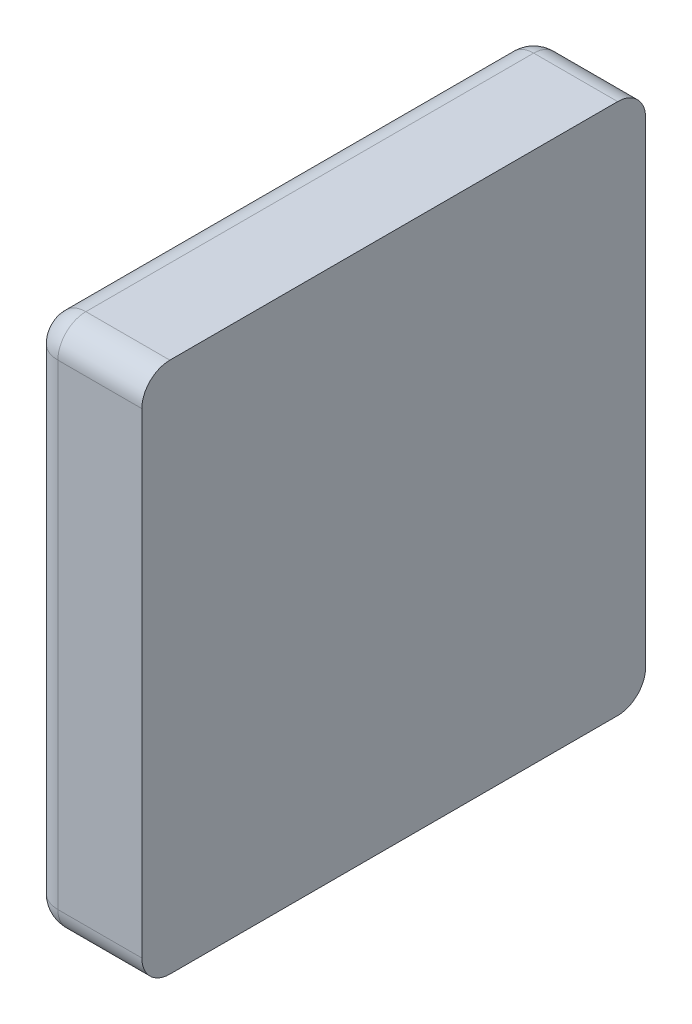
ISO-10303-21;
HEADER;
FILE_DESCRIPTION(('STEP AP214'),'2;1');
FILE_NAME('part.step','',(''),(''),'','','');
FILE_SCHEMA(('AUTOMOTIVE_DESIGN { 1 0 10303 214 1 1 1 1 }'));
ENDSEC;
DATA;
#1=APPLICATION_CONTEXT('core data for automotive mechanical design processes');
#2=APPLICATION_PROTOCOL_DEFINITION('international standard','automotive_design',2000,#1);
#3=PRODUCT_CONTEXT('',#1,'mechanical');
#4=PRODUCT('Part','Part','',(#3));
#5=PRODUCT_RELATED_PRODUCT_CATEGORY('part','',(#4));
#6=PRODUCT_DEFINITION_FORMATION('','',#4);
#7=PRODUCT_DEFINITION_CONTEXT('part definition',#1,'design');
#8=PRODUCT_DEFINITION('design','',#6,#7);
#9=PRODUCT_DEFINITION_SHAPE('','',#8);
#10=(LENGTH_UNIT() NAMED_UNIT(*) SI_UNIT(.MILLI.,.METRE.));
#11=(NAMED_UNIT(*) PLANE_ANGLE_UNIT() SI_UNIT($,.RADIAN.));
#12=(NAMED_UNIT(*) SI_UNIT($,.STERADIAN.) SOLID_ANGLE_UNIT());
#13=UNCERTAINTY_MEASURE_WITH_UNIT(LENGTH_MEASURE(1.E-05),#10,'distance_accuracy_value','');
#14=(GEOMETRIC_REPRESENTATION_CONTEXT(3) GLOBAL_UNCERTAINTY_ASSIGNED_CONTEXT((#13)) GLOBAL_UNIT_ASSIGNED_CONTEXT((#10,
#11,#12)) REPRESENTATION_CONTEXT('',''));
#15=CARTESIAN_POINT('',(0.,0.,0.));
#16=DIRECTION('',(0.,0.,1.));
#17=DIRECTION('',(1.,0.,0.));
#18=AXIS2_PLACEMENT_3D('',#15,#16,#17);
#19=CARTESIAN_POINT('',(0.,0.,0.));
#20=DIRECTION('',(1.,0.,0.));
#21=DIRECTION('',(0.,0.,-1.));
#22=AXIS2_PLACEMENT_3D('',#19,#20,#21);
#23=PLANE('',#22);
#24=DIRECTION('',(0.,0.,1.));
#25=VECTOR('',#24,1.);
#26=CARTESIAN_POINT('',(0.,0.9,0.));
#27=LINE('',#26,#25);
#28=CARTESIAN_POINT('',(0.,0.9,0.05));
#29=VERTEX_POINT('',#28);
#30=CARTESIAN_POINT('',(0.,0.9,0.85));
#31=VERTEX_POINT('',#30);
#32=EDGE_CURVE('E163',#29,#31,#27,.T.);
#33=ORIENTED_EDGE('',*,*,#32,.F.);
#34=DIRECTION('',(0.,1.,0.));
#35=VECTOR('',#34,1.);
#36=CARTESIAN_POINT('',(0.,0.,0.05));
#37=LINE('',#36,#35);
#38=CARTESIAN_POINT('',(0.,0.05,0.05));
#39=VERTEX_POINT('',#38);
#40=EDGE_CURVE('E204',#39,#29,#37,.T.);
#41=ORIENTED_EDGE('',*,*,#40,.F.);
#42=DIRECTION('',(0.,0.,1.));
#43=VECTOR('',#42,1.);
#44=CARTESIAN_POINT('',(0.,0.05,0.));
#45=LINE('',#44,#43);
#46=CARTESIAN_POINT('',(0.,0.05,0.85));
#47=VERTEX_POINT('',#46);
#48=EDGE_CURVE('E205',#47,#39,#45,.F.);
#49=ORIENTED_EDGE('',*,*,#48,.F.);
#50=DIRECTION('',(0.,1.,0.));
#51=VECTOR('',#50,1.);
#52=CARTESIAN_POINT('',(0.,0.,0.85));
#53=LINE('',#52,#51);
#54=EDGE_CURVE('E208',#31,#47,#53,.F.);
#55=ORIENTED_EDGE('',*,*,#54,.F.);
#56=EDGE_LOOP('',(#33,#41,#49,#55));
#57=FACE_BOUND('',#56,.T.);
#58=ADVANCED_FACE('F17',(#57),#23,.F.);
#59=CARTESIAN_POINT('',(0.05,0.05,0.));
#60=DIRECTION('',(0.,0.,1.));
#61=DIRECTION('',(1.,0.,0.));
#62=AXIS2_PLACEMENT_3D('',#59,#60,#61);
#63=CYLINDRICAL_SURFACE('',#62,0.05);
#64=DIRECTION('',(0.,0.,1.));
#65=VECTOR('',#64,1.);
#66=CARTESIAN_POINT('',(0.05,0.,0.));
#67=LINE('',#66,#65);
#68=CARTESIAN_POINT('',(0.05,0.,0.05));
#69=VERTEX_POINT('',#68);
#70=CARTESIAN_POINT('',(0.05,0.,0.850000000000168));
#71=VERTEX_POINT('',#70);
#72=EDGE_CURVE('E273',#69,#71,#67,.T.);
#73=ORIENTED_EDGE('',*,*,#72,.T.);
#74=CARTESIAN_POINT('',(0.05,0.05,0.85));
#75=DIRECTION('',(0.,7.66574547575187E-12,1.));
#76=DIRECTION('',(-1.,0.,0.));
#77=AXIS2_PLACEMENT_3D('',#74,#75,#76);
#78=CIRCLE('',#77,0.05);
#79=EDGE_CURVE('E211',#47,#71,#78,.T.);
#80=ORIENTED_EDGE('',*,*,#79,.F.);
#81=ORIENTED_EDGE('',*,*,#48,.T.);
#82=CARTESIAN_POINT('',(0.05,0.05,0.05));
#83=DIRECTION('',(0.,0.,1.));
#84=DIRECTION('',(-1.,0.,0.));
#85=AXIS2_PLACEMENT_3D('',#82,#83,#84);
#86=CIRCLE('',#85,0.05);
#87=EDGE_CURVE('E201',#69,#39,#86,.F.);
#88=ORIENTED_EDGE('',*,*,#87,.F.);
#89=EDGE_LOOP('',(#73,#80,#81,#88));
#90=FACE_BOUND('',#89,.T.);
#91=ADVANCED_FACE('F194',(#90),#63,.T.);
#92=CARTESIAN_POINT('',(0.05,0.05,0.05));
#93=DIRECTION('',(-1.,0.,0.));
#94=DIRECTION('',(0.,-1.,0.));
#95=AXIS2_PLACEMENT_3D('',#92,#93,#94);
#96=SPHERICAL_SURFACE('',#95,0.05);
#97=CARTESIAN_POINT('',(0.05,0.05,0.05));
#98=DIRECTION('',(1.,0.,0.));
#99=DIRECTION('',(0.,0.,-1.));
#100=AXIS2_PLACEMENT_3D('',#97,#98,#99);
#101=CIRCLE('',#100,0.05);
#102=CARTESIAN_POINT('',(0.05,0.05,0.));
#103=VERTEX_POINT('',#102);
#104=EDGE_CURVE('E73',#69,#103,#101,.T.);
#105=ORIENTED_EDGE('',*,*,#104,.F.);
#106=ORIENTED_EDGE('',*,*,#87,.T.);
#107=CARTESIAN_POINT('',(0.05,0.05,0.05));
#108=DIRECTION('',(0.,1.,0.));
#109=DIRECTION('',(0.,0.,1.));
#110=AXIS2_PLACEMENT_3D('',#107,#108,#109);
#111=CIRCLE('',#110,0.05);
#112=EDGE_CURVE('E224',#103,#39,#111,.T.);
#113=ORIENTED_EDGE('',*,*,#112,.F.);
#114=EDGE_LOOP('',(#105,#106,#113));
#115=FACE_BOUND('',#114,.T.);
#116=ADVANCED_FACE('F190',(#115),#96,.T.);
#117=CARTESIAN_POINT('',(0.05,0.,0.05));
#118=DIRECTION('',(0.,1.,0.));
#119=DIRECTION('',(0.,0.,1.));
#120=AXIS2_PLACEMENT_3D('',#117,#118,#119);
#121=CYLINDRICAL_SURFACE('',#120,0.05);
#122=DIRECTION('',(0.,1.,0.));
#123=VECTOR('',#122,1.);
#124=CARTESIAN_POINT('',(0.05,0.,0.));
#125=LINE('',#124,#123);
#126=CARTESIAN_POINT('',(0.05,0.9,0.));
#127=VERTEX_POINT('',#126);
#128=EDGE_CURVE('E77',#127,#103,#125,.F.);
#129=ORIENTED_EDGE('',*,*,#128,.T.);
#130=ORIENTED_EDGE('',*,*,#112,.T.);
#131=ORIENTED_EDGE('',*,*,#40,.T.);
#132=CARTESIAN_POINT('',(0.05,0.9,0.05));
#133=DIRECTION('',(0.,-1.,0.));
#134=DIRECTION('',(-1.,0.,0.));
#135=AXIS2_PLACEMENT_3D('',#132,#133,#134);
#136=CIRCLE('',#135,0.05);
#137=EDGE_CURVE('E173',#127,#29,#136,.F.);
#138=ORIENTED_EDGE('',*,*,#137,.F.);
#139=EDGE_LOOP('',(#129,#130,#131,#138));
#140=FACE_BOUND('',#139,.T.);
#141=ADVANCED_FACE('F186',(#140),#121,.T.);
#142=CARTESIAN_POINT('',(0.05,0.9,0.05));
#143=DIRECTION('',(-1.,0.,0.));
#144=DIRECTION('',(0.,-1.,0.));
#145=AXIS2_PLACEMENT_3D('',#142,#143,#144);
#146=SPHERICAL_SURFACE('',#145,0.05);
#147=CARTESIAN_POINT('',(0.05,0.9,0.05));
#148=DIRECTION('',(1.,0.,0.));
#149=DIRECTION('',(0.,0.,-1.));
#150=AXIS2_PLACEMENT_3D('',#147,#148,#149);
#151=CIRCLE('',#150,0.05);
#152=CARTESIAN_POINT('',(0.05,0.95,0.05));
#153=VERTEX_POINT('',#152);
#154=EDGE_CURVE('E121',#127,#153,#151,.T.);
#155=ORIENTED_EDGE('',*,*,#154,.F.);
#156=ORIENTED_EDGE('',*,*,#137,.T.);
#157=CARTESIAN_POINT('',(0.05,0.9,0.05));
#158=DIRECTION('',(0.,0.,1.));
#159=DIRECTION('',(1.,0.,0.));
#160=AXIS2_PLACEMENT_3D('',#157,#158,#159);
#161=CIRCLE('',#160,0.05);
#162=EDGE_CURVE('E170',#153,#29,#161,.T.);
#163=ORIENTED_EDGE('',*,*,#162,.F.);
#164=EDGE_LOOP('',(#155,#156,#163));
#165=FACE_BOUND('',#164,.T.);
#166=ADVANCED_FACE('F183',(#165),#146,.T.);
#167=CARTESIAN_POINT('',(0.05,0.9,0.));
#168=DIRECTION('',(0.,0.,1.));
#169=DIRECTION('',(1.,0.,0.));
#170=AXIS2_PLACEMENT_3D('',#167,#168,#169);
#171=CYLINDRICAL_SURFACE('',#170,0.05);
#172=ORIENTED_EDGE('',*,*,#162,.T.);
#173=ORIENTED_EDGE('',*,*,#32,.T.);
#174=CARTESIAN_POINT('',(0.05,0.9,0.85));
#175=DIRECTION('',(0.,0.,-1.));
#176=DIRECTION('',(-1.,0.,0.));
#177=AXIS2_PLACEMENT_3D('',#174,#175,#176);
#178=CIRCLE('',#177,0.05);
#179=CARTESIAN_POINT('',(0.05,0.95,0.85));
#180=VERTEX_POINT('',#179);
#181=EDGE_CURVE('E159',#180,#31,#178,.F.);
#182=ORIENTED_EDGE('',*,*,#181,.F.);
#183=DIRECTION('',(0.,0.,1.));
#184=VECTOR('',#183,1.);
#185=CARTESIAN_POINT('',(0.05,0.95,0.));
#186=LINE('',#185,#184);
#187=EDGE_CURVE('E115',#153,#180,#186,.T.);
#188=ORIENTED_EDGE('',*,*,#187,.F.);
#189=EDGE_LOOP('',(#172,#173,#182,#188));
#190=FACE_BOUND('',#189,.T.);
#191=ADVANCED_FACE('F151',(#190),#171,.T.);
#192=CARTESIAN_POINT('',(0.05,0.9,0.85));
#193=DIRECTION('',(-1.,0.,0.));
#194=DIRECTION('',(0.,0.,-1.));
#195=AXIS2_PLACEMENT_3D('',#192,#193,#194);
#196=SPHERICAL_SURFACE('',#195,0.05);
#197=CARTESIAN_POINT('',(0.05,0.9,0.85));
#198=DIRECTION('',(1.,0.,0.));
#199=DIRECTION('',(0.,0.,-1.));
#200=AXIS2_PLACEMENT_3D('',#197,#198,#199);
#201=CIRCLE('',#200,0.05);
#202=CARTESIAN_POINT('',(0.05,0.9,0.9));
#203=VERTEX_POINT('',#202);
#204=EDGE_CURVE('E114',#180,#203,#201,.T.);
#205=ORIENTED_EDGE('',*,*,#204,.F.);
#206=ORIENTED_EDGE('',*,*,#181,.T.);
#207=CARTESIAN_POINT('',(0.05,0.9,0.85));
#208=DIRECTION('',(0.,1.,0.));
#209=DIRECTION('',(0.,0.,1.));
#210=AXIS2_PLACEMENT_3D('',#207,#208,#209);
#211=CIRCLE('',#210,0.05);
#212=EDGE_CURVE('E162',#203,#31,#211,.F.);
#213=ORIENTED_EDGE('',*,*,#212,.F.);
#214=EDGE_LOOP('',(#205,#206,#213));
#215=FACE_BOUND('',#214,.T.);
#216=ADVANCED_FACE('F146',(#215),#196,.T.);
#217=CARTESIAN_POINT('',(0.05,0.,0.85));
#218=DIRECTION('',(0.,1.,0.));
#219=DIRECTION('',(0.,0.,1.));
#220=AXIS2_PLACEMENT_3D('',#217,#218,#219);
#221=CYLINDRICAL_SURFACE('',#220,0.05);
#222=ORIENTED_EDGE('',*,*,#212,.T.);
#223=ORIENTED_EDGE('',*,*,#54,.T.);
#224=CARTESIAN_POINT('',(0.05,0.05,0.85));
#225=DIRECTION('',(0.,1.,0.));
#226=DIRECTION('',(-1.,0.,0.));
#227=AXIS2_PLACEMENT_3D('',#224,#225,#226);
#228=CIRCLE('',#227,0.05);
#229=CARTESIAN_POINT('',(0.05,0.05,0.9));
#230=VERTEX_POINT('',#229);
#231=EDGE_CURVE('E275',#230,#47,#228,.F.);
#232=ORIENTED_EDGE('',*,*,#231,.F.);
#233=DIRECTION('',(0.,1.,0.));
#234=VECTOR('',#233,1.);
#235=CARTESIAN_POINT('',(0.05,0.,0.9));
#236=LINE('',#235,#234);
#237=EDGE_CURVE('E108',#203,#230,#236,.F.);
#238=ORIENTED_EDGE('',*,*,#237,.F.);
#239=EDGE_LOOP('',(#222,#223,#232,#238));
#240=FACE_BOUND('',#239,.T.);
#241=ADVANCED_FACE('F141',(#240),#221,.T.);
#242=CARTESIAN_POINT('',(0.05,0.05,0.85));
#243=DIRECTION('',(-1.,0.,0.));
#244=DIRECTION('',(0.,1.,0.));
#245=AXIS2_PLACEMENT_3D('',#242,#243,#244);
#246=SPHERICAL_SURFACE('',#245,0.05);
#247=CARTESIAN_POINT('',(0.05,0.05,0.85));
#248=DIRECTION('',(1.,0.,0.));
#249=DIRECTION('',(0.,0.,-1.));
#250=AXIS2_PLACEMENT_3D('',#247,#248,#249);
#251=CIRCLE('',#250,0.05);
#252=EDGE_CURVE('E91',#230,#71,#251,.T.);
#253=ORIENTED_EDGE('',*,*,#252,.F.);
#254=ORIENTED_EDGE('',*,*,#231,.T.);
#255=ORIENTED_EDGE('',*,*,#79,.T.);
#256=EDGE_LOOP('',(#253,#254,#255));
#257=FACE_BOUND('',#256,.T.);
#258=ADVANCED_FACE('F136',(#257),#246,.T.);
#259=CARTESIAN_POINT('',(0.,0.,0.));
#260=DIRECTION('',(0.,1.,0.));
#261=DIRECTION('',(0.,0.,1.));
#262=AXIS2_PLACEMENT_3D('',#259,#260,#261);
#263=PLANE('',#262);
#264=DIRECTION('',(1.,0.,0.));
#265=VECTOR('',#264,1.);
#266=CARTESIAN_POINT('',(0.,0.,0.85));
#267=LINE('',#266,#265);
#268=CARTESIAN_POINT('',(0.2,0.,0.85));
#269=VERTEX_POINT('',#268);
#270=EDGE_CURVE('E97',#71,#269,#267,.T.);
#271=ORIENTED_EDGE('',*,*,#270,.F.);
#272=ORIENTED_EDGE('',*,*,#72,.F.);
#273=DIRECTION('',(1.,0.,0.));
#274=VECTOR('',#273,1.);
#275=CARTESIAN_POINT('',(0.,0.,0.05));
#276=LINE('',#275,#274);
#277=CARTESIAN_POINT('',(0.2,0.,0.05));
#278=VERTEX_POINT('',#277);
#279=EDGE_CURVE('E60',#278,#69,#276,.F.);
#280=ORIENTED_EDGE('',*,*,#279,.F.);
#281=DIRECTION('',(0.,0.,-1.));
#282=VECTOR('',#281,1.);
#283=CARTESIAN_POINT('',(0.2,0.,0.));
#284=LINE('',#283,#282);
#285=EDGE_CURVE('E90',#269,#278,#284,.T.);
#286=ORIENTED_EDGE('',*,*,#285,.F.);
#287=EDGE_LOOP('',(#271,#272,#280,#286));
#288=FACE_BOUND('',#287,.T.);
#289=ADVANCED_FACE('F140',(#288),#263,.F.);
#290=CARTESIAN_POINT('',(0.,0.05,0.05));
#291=DIRECTION('',(1.,0.,0.));
#292=DIRECTION('',(0.,0.,-1.));
#293=AXIS2_PLACEMENT_3D('',#290,#291,#292);
#294=CYLINDRICAL_SURFACE('',#293,0.05);
#295=CARTESIAN_POINT('',(0.2,0.05,0.05));
#296=DIRECTION('',(1.,0.,0.));
#297=DIRECTION('',(0.,0.,-1.));
#298=AXIS2_PLACEMENT_3D('',#295,#296,#297);
#299=CIRCLE('',#298,0.05);
#300=CARTESIAN_POINT('',(0.2,0.05,0.));
#301=VERTEX_POINT('',#300);
#302=EDGE_CURVE('E20',#278,#301,#299,.T.);
#303=ORIENTED_EDGE('',*,*,#302,.F.);
#304=ORIENTED_EDGE('',*,*,#279,.T.);
#305=ORIENTED_EDGE('',*,*,#104,.T.);
#306=DIRECTION('',(1.,0.,0.));
#307=VECTOR('',#306,1.);
#308=CARTESIAN_POINT('',(0.,0.05,0.));
#309=LINE('',#308,#307);
#310=EDGE_CURVE('E66',#103,#301,#309,.T.);
#311=ORIENTED_EDGE('',*,*,#310,.T.);
#312=EDGE_LOOP('',(#303,#304,#305,#311));
#313=FACE_BOUND('',#312,.T.);
#314=ADVANCED_FACE('F68',(#313),#294,.T.);
#315=CARTESIAN_POINT('',(0.,0.,0.));
#316=DIRECTION('',(0.,0.,1.));
#317=DIRECTION('',(1.,0.,0.));
#318=AXIS2_PLACEMENT_3D('',#315,#316,#317);
#319=PLANE('',#318);
#320=DIRECTION('',(0.,1.,0.));
#321=VECTOR('',#320,1.);
#322=CARTESIAN_POINT('',(0.2,0.,0.));
#323=LINE('',#322,#321);
#324=CARTESIAN_POINT('',(0.2,0.9,0.));
#325=VERTEX_POINT('',#324);
#326=EDGE_CURVE('E80',#301,#325,#323,.T.);
#327=ORIENTED_EDGE('',*,*,#326,.F.);
#328=ORIENTED_EDGE('',*,*,#310,.F.);
#329=ORIENTED_EDGE('',*,*,#128,.F.);
#330=DIRECTION('',(1.,0.,0.));
#331=VECTOR('',#330,1.);
#332=CARTESIAN_POINT('',(0.,0.9,0.));
#333=LINE('',#332,#331);
#334=EDGE_CURVE('E76',#325,#127,#333,.F.);
#335=ORIENTED_EDGE('',*,*,#334,.F.);
#336=EDGE_LOOP('',(#327,#328,#329,#335));
#337=FACE_BOUND('',#336,.T.);
#338=ADVANCED_FACE('F81',(#337),#319,.F.);
#339=CARTESIAN_POINT('',(0.,0.9,0.05));
#340=DIRECTION('',(1.,0.,0.));
#341=DIRECTION('',(0.,0.,-1.));
#342=AXIS2_PLACEMENT_3D('',#339,#340,#341);
#343=CYLINDRICAL_SURFACE('',#342,0.05);
#344=ORIENTED_EDGE('',*,*,#334,.T.);
#345=ORIENTED_EDGE('',*,*,#154,.T.);
#346=DIRECTION('',(1.,0.,0.));
#347=VECTOR('',#346,1.);
#348=CARTESIAN_POINT('',(0.,0.95,0.05));
#349=LINE('',#348,#347);
#350=CARTESIAN_POINT('',(0.2,0.95,0.05));
#351=VERTEX_POINT('',#350);
#352=EDGE_CURVE('E118',#351,#153,#349,.F.);
#353=ORIENTED_EDGE('',*,*,#352,.F.);
#354=CARTESIAN_POINT('',(0.2,0.9,0.05));
#355=DIRECTION('',(1.,0.,0.));
#356=DIRECTION('',(0.,0.,-1.));
#357=AXIS2_PLACEMENT_3D('',#354,#355,#356);
#358=CIRCLE('',#357,0.05);
#359=EDGE_CURVE('E86',#325,#351,#358,.T.);
#360=ORIENTED_EDGE('',*,*,#359,.F.);
#361=EDGE_LOOP('',(#344,#345,#353,#360));
#362=FACE_BOUND('',#361,.T.);
#363=ADVANCED_FACE('F326',(#362),#343,.T.);
#364=CARTESIAN_POINT('',(0.,0.95,0.));
#365=DIRECTION('',(0.,1.,0.));
#366=DIRECTION('',(0.,0.,1.));
#367=AXIS2_PLACEMENT_3D('',#364,#365,#366);
#368=PLANE('',#367);
#369=DIRECTION('',(1.,0.,0.));
#370=VECTOR('',#369,1.);
#371=CARTESIAN_POINT('',(0.,0.95,0.85));
#372=LINE('',#371,#370);
#373=CARTESIAN_POINT('',(0.2,0.95,0.85));
#374=VERTEX_POINT('',#373);
#375=EDGE_CURVE('E111',#374,#180,#372,.F.);
#376=ORIENTED_EDGE('',*,*,#375,.F.);
#377=DIRECTION('',(0.,0.,-1.));
#378=VECTOR('',#377,1.);
#379=CARTESIAN_POINT('',(0.2,0.95,0.));
#380=LINE('',#379,#378);
#381=EDGE_CURVE('E229',#351,#374,#380,.F.);
#382=ORIENTED_EDGE('',*,*,#381,.F.);
#383=ORIENTED_EDGE('',*,*,#352,.T.);
#384=ORIENTED_EDGE('',*,*,#187,.T.);
#385=EDGE_LOOP('',(#376,#382,#383,#384));
#386=FACE_BOUND('',#385,.T.);
#387=ADVANCED_FACE('F323',(#386),#368,.T.);
#388=CARTESIAN_POINT('',(0.,0.9,0.85));
#389=DIRECTION('',(1.,0.,0.));
#390=DIRECTION('',(0.,0.,-1.));
#391=AXIS2_PLACEMENT_3D('',#388,#389,#390);
#392=CYLINDRICAL_SURFACE('',#391,0.05);
#393=DIRECTION('',(1.,0.,0.));
#394=VECTOR('',#393,1.);
#395=CARTESIAN_POINT('',(0.,0.9,0.9));
#396=LINE('',#395,#394);
#397=CARTESIAN_POINT('',(0.2,0.9,0.9));
#398=VERTEX_POINT('',#397);
#399=EDGE_CURVE('E100',#398,#203,#396,.F.);
#400=ORIENTED_EDGE('',*,*,#399,.F.);
#401=CARTESIAN_POINT('',(0.2,0.9,0.85));
#402=DIRECTION('',(1.,0.,0.));
#403=DIRECTION('',(0.,0.,-1.));
#404=AXIS2_PLACEMENT_3D('',#401,#402,#403);
#405=CIRCLE('',#404,0.05);
#406=EDGE_CURVE('E227',#374,#398,#405,.T.);
#407=ORIENTED_EDGE('',*,*,#406,.F.);
#408=ORIENTED_EDGE('',*,*,#375,.T.);
#409=ORIENTED_EDGE('',*,*,#204,.T.);
#410=EDGE_LOOP('',(#400,#407,#408,#409));
#411=FACE_BOUND('',#410,.T.);
#412=ADVANCED_FACE('F244',(#411),#392,.T.);
#413=CARTESIAN_POINT('',(0.,0.,0.9));
#414=DIRECTION('',(0.,0.,1.));
#415=DIRECTION('',(1.,0.,0.));
#416=AXIS2_PLACEMENT_3D('',#413,#414,#415);
#417=PLANE('',#416);
#418=DIRECTION('',(0.,1.,0.));
#419=VECTOR('',#418,1.);
#420=CARTESIAN_POINT('',(0.2,0.,0.9));
#421=LINE('',#420,#419);
#422=CARTESIAN_POINT('',(0.2,0.05,0.9));
#423=VERTEX_POINT('',#422);
#424=EDGE_CURVE('E26',#398,#423,#421,.F.);
#425=ORIENTED_EDGE('',*,*,#424,.F.);
#426=ORIENTED_EDGE('',*,*,#399,.T.);
#427=ORIENTED_EDGE('',*,*,#237,.T.);
#428=DIRECTION('',(1.,0.,0.));
#429=VECTOR('',#428,1.);
#430=CARTESIAN_POINT('',(0.,0.05,0.9));
#431=LINE('',#430,#429);
#432=EDGE_CURVE('E35',#423,#230,#431,.F.);
#433=ORIENTED_EDGE('',*,*,#432,.F.);
#434=EDGE_LOOP('',(#425,#426,#427,#433));
#435=FACE_BOUND('',#434,.T.);
#436=ADVANCED_FACE('F234',(#435),#417,.T.);
#437=CARTESIAN_POINT('',(0.,0.05,0.85));
#438=DIRECTION('',(1.,0.,0.));
#439=DIRECTION('',(0.,0.,-1.));
#440=AXIS2_PLACEMENT_3D('',#437,#438,#439);
#441=CYLINDRICAL_SURFACE('',#440,0.05);
#442=ORIENTED_EDGE('',*,*,#432,.T.);
#443=ORIENTED_EDGE('',*,*,#252,.T.);
#444=ORIENTED_EDGE('',*,*,#270,.T.);
#445=CARTESIAN_POINT('',(0.2,0.05,0.85));
#446=DIRECTION('',(1.,0.,0.));
#447=DIRECTION('',(0.,0.,-1.));
#448=AXIS2_PLACEMENT_3D('',#445,#446,#447);
#449=CIRCLE('',#448,0.05);
#450=EDGE_CURVE('E11',#423,#269,#449,.T.);
#451=ORIENTED_EDGE('',*,*,#450,.F.);
#452=EDGE_LOOP('',(#442,#443,#444,#451));
#453=FACE_BOUND('',#452,.T.);
#454=ADVANCED_FACE('F308',(#453),#441,.T.);
#455=CARTESIAN_POINT('',(0.2,0.,0.));
#456=DIRECTION('',(1.,0.,0.));
#457=DIRECTION('',(0.,0.,-1.));
#458=AXIS2_PLACEMENT_3D('',#455,#456,#457);
#459=PLANE('',#458);
#460=ORIENTED_EDGE('',*,*,#424,.T.);
#461=ORIENTED_EDGE('',*,*,#450,.T.);
#462=ORIENTED_EDGE('',*,*,#285,.T.);
#463=ORIENTED_EDGE('',*,*,#302,.T.);
#464=ORIENTED_EDGE('',*,*,#326,.T.);
#465=ORIENTED_EDGE('',*,*,#359,.T.);
#466=ORIENTED_EDGE('',*,*,#381,.T.);
#467=ORIENTED_EDGE('',*,*,#406,.T.);
#468=EDGE_LOOP('',(#460,#461,#462,#463,#464,#465,#466,#467));
#469=FACE_BOUND('',#468,.T.);
#470=ADVANCED_FACE('F89',(#469),#459,.T.);
#471=CLOSED_SHELL('',(#58,#91,#116,#141,#166,#191,#216,#241,#258,#289,#314,#338,#363,#387,#412,
#436,#454,#470));
#472=MANIFOLD_SOLID_BREP('B1',#471);
#473=ADVANCED_BREP_SHAPE_REPRESENTATION('',(#18,#472),#14);
#474=SHAPE_DEFINITION_REPRESENTATION(#9,#473);
ENDSEC;
END-ISO-10303-21;
